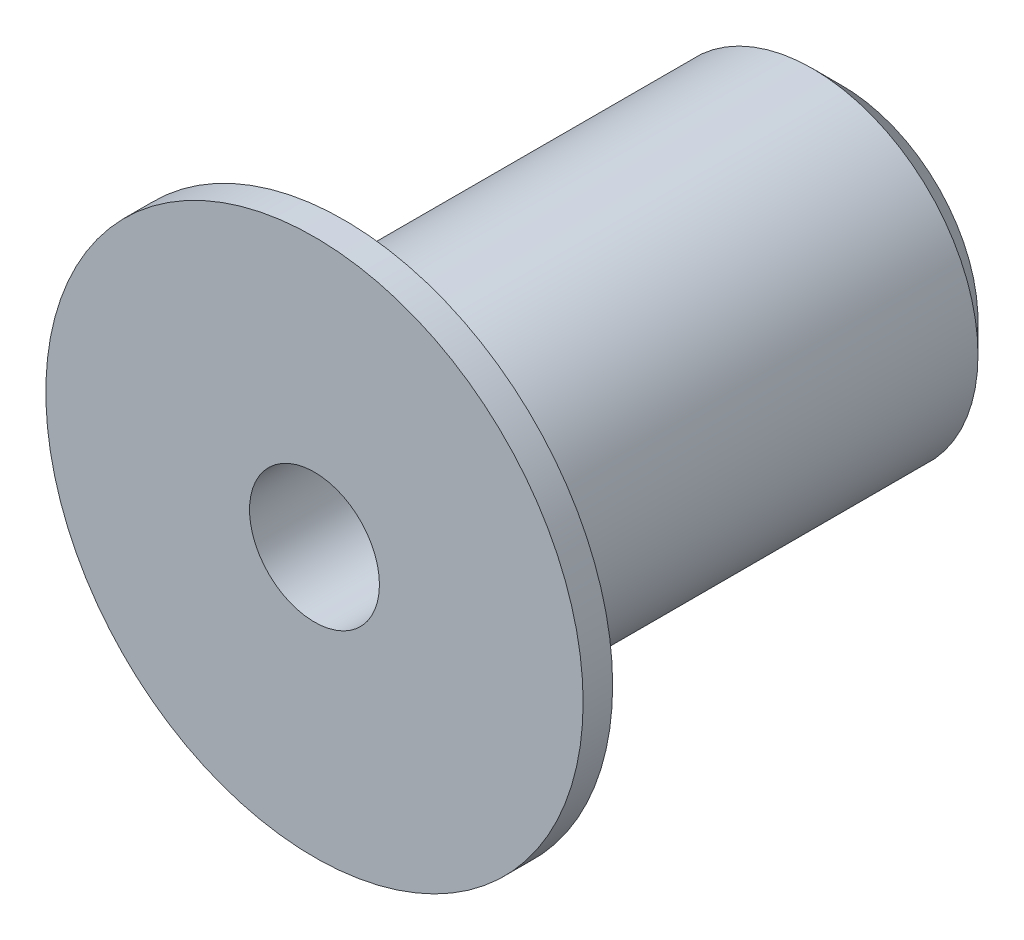
ISO-10303-21;
HEADER;
FILE_DESCRIPTION(('STEP AP214'),'2;1');
FILE_NAME('part.step','',(''),(''),'','','');
FILE_SCHEMA(('AUTOMOTIVE_DESIGN { 1 0 10303 214 1 1 1 1 }'));
ENDSEC;
DATA;
#1=APPLICATION_CONTEXT('core data for automotive mechanical design processes');
#2=APPLICATION_PROTOCOL_DEFINITION('international standard','automotive_design',2000,#1);
#3=PRODUCT_CONTEXT('',#1,'mechanical');
#4=PRODUCT('Part','Part','',(#3));
#5=PRODUCT_RELATED_PRODUCT_CATEGORY('part','',(#4));
#6=PRODUCT_DEFINITION_FORMATION('','',#4);
#7=PRODUCT_DEFINITION_CONTEXT('part definition',#1,'design');
#8=PRODUCT_DEFINITION('design','',#6,#7);
#9=PRODUCT_DEFINITION_SHAPE('','',#8);
#10=(LENGTH_UNIT() NAMED_UNIT(*) SI_UNIT(.MILLI.,.METRE.));
#11=(NAMED_UNIT(*) PLANE_ANGLE_UNIT() SI_UNIT($,.RADIAN.));
#12=(NAMED_UNIT(*) SI_UNIT($,.STERADIAN.) SOLID_ANGLE_UNIT());
#13=UNCERTAINTY_MEASURE_WITH_UNIT(LENGTH_MEASURE(1.E-05),#10,'distance_accuracy_value','');
#14=(GEOMETRIC_REPRESENTATION_CONTEXT(3) GLOBAL_UNCERTAINTY_ASSIGNED_CONTEXT((#13)) GLOBAL_UNIT_ASSIGNED_CONTEXT((#10,
#11,#12)) REPRESENTATION_CONTEXT('',''));
#15=CARTESIAN_POINT('',(0.,0.,0.));
#16=DIRECTION('',(0.,0.,1.));
#17=DIRECTION('',(1.,0.,0.));
#18=AXIS2_PLACEMENT_3D('',#15,#16,#17);
#19=CARTESIAN_POINT('',(0.,19.55,33.45));
#20=DIRECTION('',(0.,0.,1.));
#21=DIRECTION('',(1.,0.,0.));
#22=AXIS2_PLACEMENT_3D('',#19,#20,#21);
#23=CYLINDRICAL_SURFACE('',#22,2.8);
#24=CARTESIAN_POINT('',(0.,19.55,25.0125));
#25=DIRECTION('',(0.,0.,-1.));
#26=DIRECTION('',(-1.,0.,0.));
#27=AXIS2_PLACEMENT_3D('',#24,#25,#26);
#28=CIRCLE('',#27,2.8);
#29=CARTESIAN_POINT('',(-2.8,19.55,25.0125));
#30=VERTEX_POINT('',#29);
#31=EDGE_CURVE('E43',#30,#30,#28,.F.);
#32=ORIENTED_EDGE('',*,*,#31,.T.);
#33=EDGE_LOOP('',(#32));
#34=FACE_BOUND('',#33,.T.);
#35=CARTESIAN_POINT('',(0.,19.55,32.45));
#36=DIRECTION('',(0.,0.,1.));
#37=DIRECTION('',(1.,0.,0.));
#38=AXIS2_PLACEMENT_3D('',#35,#36,#37);
#39=CIRCLE('',#38,2.8);
#40=CARTESIAN_POINT('',(2.8,19.55,32.45));
#41=VERTEX_POINT('',#40);
#42=EDGE_CURVE('E47',#41,#41,#39,.T.);
#43=ORIENTED_EDGE('',*,*,#42,.F.);
#44=EDGE_LOOP('',(#43));
#45=FACE_BOUND('',#44,.T.);
#46=ADVANCED_FACE('F35',(#34,#45),#23,.T.);
#47=CARTESIAN_POINT('',(0.,19.55,32.95));
#48=DIRECTION('',(0.,0.,1.));
#49=DIRECTION('',(1.,0.,0.));
#50=AXIS2_PLACEMENT_3D('',#47,#48,#49);
#51=CONICAL_SURFACE('',#50,4.55,1.29249666778979);
#52=ORIENTED_EDGE('',*,*,#42,.T.);
#53=EDGE_LOOP('',(#52));
#54=FACE_BOUND('',#53,.T.);
#55=CARTESIAN_POINT('',(0.,19.55,32.95));
#56=DIRECTION('',(0.,0.,1.));
#57=DIRECTION('',(1.,0.,0.));
#58=AXIS2_PLACEMENT_3D('',#55,#56,#57);
#59=CIRCLE('',#58,4.55);
#60=CARTESIAN_POINT('',(4.55,19.55,32.95));
#61=VERTEX_POINT('',#60);
#62=EDGE_CURVE('E51',#61,#61,#59,.T.);
#63=ORIENTED_EDGE('',*,*,#62,.F.);
#64=EDGE_LOOP('',(#63));
#65=FACE_BOUND('',#64,.T.);
#66=ADVANCED_FACE('F82',(#54,#65),#51,.T.);
#67=CARTESIAN_POINT('',(0.,19.55,33.45));
#68=DIRECTION('',(0.,0.,1.));
#69=DIRECTION('',(1.,0.,0.));
#70=AXIS2_PLACEMENT_3D('',#67,#68,#69);
#71=CYLINDRICAL_SURFACE('',#70,4.55);
#72=ORIENTED_EDGE('',*,*,#62,.T.);
#73=EDGE_LOOP('',(#72));
#74=FACE_BOUND('',#73,.T.);
#75=CARTESIAN_POINT('',(0.,19.55,33.45));
#76=DIRECTION('',(0.,0.,1.));
#77=DIRECTION('',(1.,0.,0.));
#78=AXIS2_PLACEMENT_3D('',#75,#76,#77);
#79=CIRCLE('',#78,4.55);
#80=CARTESIAN_POINT('',(4.55,19.55,33.45));
#81=VERTEX_POINT('',#80);
#82=EDGE_CURVE('E56',#81,#81,#79,.T.);
#83=ORIENTED_EDGE('',*,*,#82,.F.);
#84=EDGE_LOOP('',(#83));
#85=FACE_BOUND('',#84,.T.);
#86=ADVANCED_FACE('F76',(#74,#85),#71,.T.);
#87=CARTESIAN_POINT('',(0.,0.,33.45));
#88=DIRECTION('',(0.,0.,1.));
#89=DIRECTION('',(1.,0.,0.));
#90=AXIS2_PLACEMENT_3D('',#87,#88,#89);
#91=PLANE('',#90);
#92=ORIENTED_EDGE('',*,*,#82,.T.);
#93=EDGE_LOOP('',(#92));
#94=FACE_BOUND('',#93,.T.);
#95=CARTESIAN_POINT('',(0.,19.55,33.45));
#96=DIRECTION('',(0.,0.,1.));
#97=DIRECTION('',(1.,0.,0.));
#98=AXIS2_PLACEMENT_3D('',#95,#96,#97);
#99=CIRCLE('',#98,1.09999999999999);
#100=CARTESIAN_POINT('',(1.09999999999999,19.55,33.45));
#101=VERTEX_POINT('',#100);
#102=EDGE_CURVE('E59',#101,#101,#99,.T.);
#103=ORIENTED_EDGE('',*,*,#102,.F.);
#104=EDGE_LOOP('',(#103));
#105=FACE_BOUND('',#104,.T.);
#106=ADVANCED_FACE('F71',(#94,#105),#91,.T.);
#107=CARTESIAN_POINT('',(0.,19.55,33.45));
#108=DIRECTION('',(0.,0.,1.));
#109=DIRECTION('',(1.,0.,0.));
#110=AXIS2_PLACEMENT_3D('',#107,#108,#109);
#111=CYLINDRICAL_SURFACE('',#110,1.09999999999999);
#112=CARTESIAN_POINT('',(0.,19.55,24.5125));
#113=DIRECTION('',(0.,0.,1.));
#114=DIRECTION('',(1.,0.,0.));
#115=AXIS2_PLACEMENT_3D('',#112,#113,#114);
#116=CIRCLE('',#115,1.09999999999999);
#117=CARTESIAN_POINT('',(1.09999999999999,19.55,24.5125));
#118=VERTEX_POINT('',#117);
#119=EDGE_CURVE('E62',#118,#118,#116,.T.);
#120=ORIENTED_EDGE('',*,*,#119,.F.);
#121=EDGE_LOOP('',(#120));
#122=FACE_BOUND('',#121,.T.);
#123=ORIENTED_EDGE('',*,*,#102,.T.);
#124=EDGE_LOOP('',(#123));
#125=FACE_BOUND('',#124,.T.);
#126=ADVANCED_FACE('F68',(#122,#125),#111,.F.);
#127=CARTESIAN_POINT('',(0.,0.,24.5125));
#128=DIRECTION('',(0.,0.,-1.));
#129=DIRECTION('',(-1.,0.,0.));
#130=AXIS2_PLACEMENT_3D('',#127,#128,#129);
#131=PLANE('',#130);
#132=CARTESIAN_POINT('',(0.,19.55,24.5125));
#133=DIRECTION('',(0.,0.,-1.));
#134=DIRECTION('',(-1.,0.,0.));
#135=AXIS2_PLACEMENT_3D('',#132,#133,#134);
#136=CIRCLE('',#135,2.29999999999999);
#137=CARTESIAN_POINT('',(-2.29999999999999,19.55,24.5125));
#138=VERTEX_POINT('',#137);
#139=EDGE_CURVE('E10',#138,#138,#136,.T.);
#140=ORIENTED_EDGE('',*,*,#139,.T.);
#141=EDGE_LOOP('',(#140));
#142=FACE_BOUND('',#141,.T.);
#143=ORIENTED_EDGE('',*,*,#119,.T.);
#144=EDGE_LOOP('',(#143));
#145=FACE_BOUND('',#144,.T.);
#146=ADVANCED_FACE('F66',(#142,#145),#131,.T.);
#147=CARTESIAN_POINT('',(0.,19.55,25.0125));
#148=DIRECTION('',(0.,0.,1.));
#149=DIRECTION('',(1.,0.,0.));
#150=AXIS2_PLACEMENT_3D('',#147,#148,#149);
#151=CONICAL_SURFACE('',#150,2.8,0.78539816339745);
#152=ORIENTED_EDGE('',*,*,#139,.F.);
#153=EDGE_LOOP('',(#152));
#154=FACE_BOUND('',#153,.T.);
#155=ORIENTED_EDGE('',*,*,#31,.F.);
#156=EDGE_LOOP('',(#155));
#157=FACE_BOUND('',#156,.T.);
#158=ADVANCED_FACE('F38',(#154,#157),#151,.T.);
#159=CLOSED_SHELL('',(#46,#66,#86,#106,#126,#146,#158));
#160=MANIFOLD_SOLID_BREP('B2',#159);
#161=ADVANCED_BREP_SHAPE_REPRESENTATION('',(#18,#160),#14);
#162=SHAPE_DEFINITION_REPRESENTATION(#9,#161);
ENDSEC;
END-ISO-10303-21;
